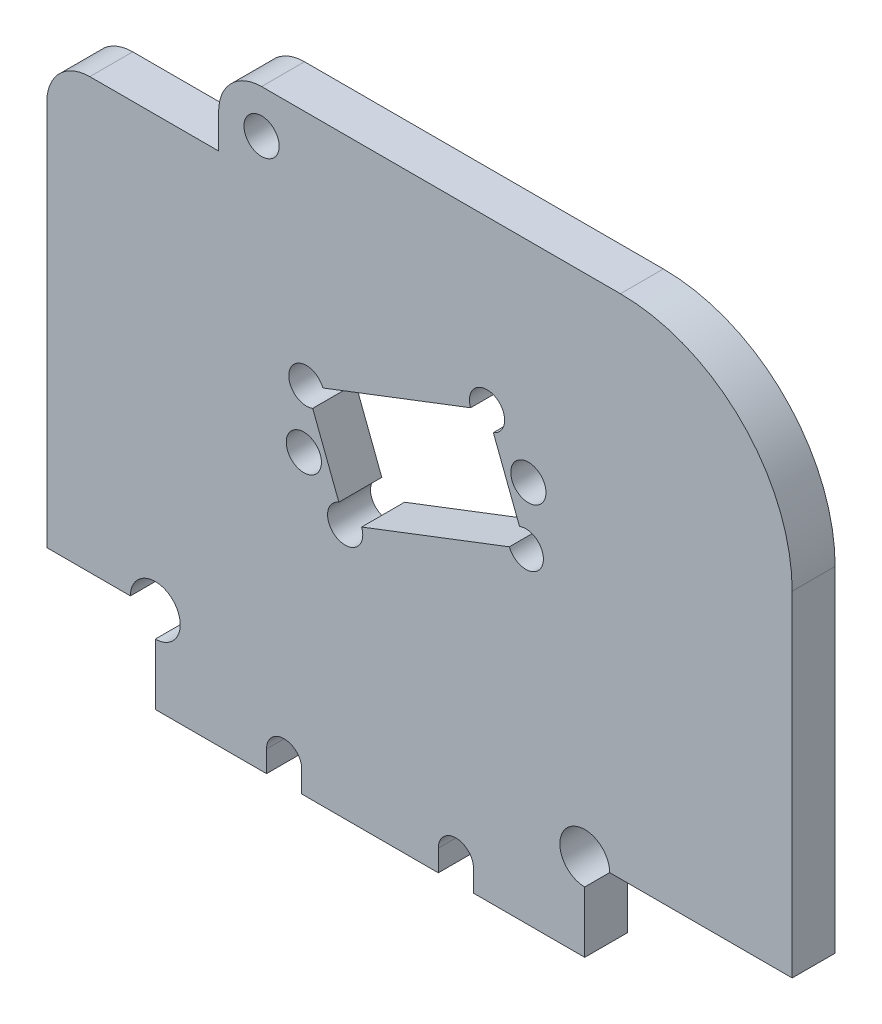
ISO-10303-21;
HEADER;
FILE_DESCRIPTION(('STEP AP214'),'2;1');
FILE_NAME('part.step','',(''),(''),'','','');
FILE_SCHEMA(('AUTOMOTIVE_DESIGN { 1 0 10303 214 1 1 1 1 }'));
ENDSEC;
DATA;
#1=APPLICATION_CONTEXT('core data for automotive mechanical design processes');
#2=APPLICATION_PROTOCOL_DEFINITION('international standard','automotive_design',2000,#1);
#3=PRODUCT_CONTEXT('',#1,'mechanical');
#4=PRODUCT('Part','Part','',(#3));
#5=PRODUCT_RELATED_PRODUCT_CATEGORY('part','',(#4));
#6=PRODUCT_DEFINITION_FORMATION('','',#4);
#7=PRODUCT_DEFINITION_CONTEXT('part definition',#1,'design');
#8=PRODUCT_DEFINITION('design','',#6,#7);
#9=PRODUCT_DEFINITION_SHAPE('','',#8);
#10=(LENGTH_UNIT() NAMED_UNIT(*) SI_UNIT(.MILLI.,.METRE.));
#11=(NAMED_UNIT(*) PLANE_ANGLE_UNIT() SI_UNIT($,.RADIAN.));
#12=(NAMED_UNIT(*) SI_UNIT($,.STERADIAN.) SOLID_ANGLE_UNIT());
#13=UNCERTAINTY_MEASURE_WITH_UNIT(LENGTH_MEASURE(1.E-05),#10,'distance_accuracy_value','');
#14=(GEOMETRIC_REPRESENTATION_CONTEXT(3) GLOBAL_UNCERTAINTY_ASSIGNED_CONTEXT((#13)) GLOBAL_UNIT_ASSIGNED_CONTEXT((#10,
#11,#12)) REPRESENTATION_CONTEXT('',''));
#15=CARTESIAN_POINT('',(0.,0.,0.));
#16=DIRECTION('',(0.,0.,1.));
#17=DIRECTION('',(1.,0.,0.));
#18=AXIS2_PLACEMENT_3D('',#15,#16,#17);
#19=CARTESIAN_POINT('',(0.,-41.3725830020304,5.));
#20=DIRECTION('',(0.,-1.,0.));
#21=DIRECTION('',(1.,0.,0.));
#22=AXIS2_PLACEMENT_3D('',#19,#20,#21);
#23=PLANE('',#22);
#24=DIRECTION('',(0.,0.,1.));
#25=VECTOR('',#24,1.);
#26=CARTESIAN_POINT('',(2.05000000000001,-41.3725830020304,-0.00100000000000013));
#27=LINE('',#26,#25);
#28=CARTESIAN_POINT('',(2.05000000000002,-41.3725830020304,5.));
#29=VERTEX_POINT('',#28);
#30=CARTESIAN_POINT('',(2.05000000000001,-41.3725830020304,0.));
#31=VERTEX_POINT('',#30);
#32=EDGE_CURVE('E542',#29,#31,#27,.F.);
#33=ORIENTED_EDGE('',*,*,#32,.T.);
#34=DIRECTION('',(-1.,0.,0.));
#35=VECTOR('',#34,1.);
#36=CARTESIAN_POINT('',(0.,-41.3725830020304,0.));
#37=LINE('',#36,#35);
#38=CARTESIAN_POINT('',(15.,-41.3725830020305,0.));
#39=VERTEX_POINT('',#38);
#40=EDGE_CURVE('E350',#39,#31,#37,.T.);
#41=ORIENTED_EDGE('',*,*,#40,.F.);
#42=DIRECTION('',(0.,0.,-1.));
#43=VECTOR('',#42,1.);
#44=CARTESIAN_POINT('',(15.,-41.3725830020304,5.));
#45=LINE('',#44,#43);
#46=CARTESIAN_POINT('',(15.,-41.3725830020305,5.));
#47=VERTEX_POINT('',#46);
#48=EDGE_CURVE('E501',#47,#39,#45,.T.);
#49=ORIENTED_EDGE('',*,*,#48,.F.);
#50=DIRECTION('',(-1.,0.,0.));
#51=VECTOR('',#50,1.);
#52=CARTESIAN_POINT('',(0.,-41.3725830020304,5.));
#53=LINE('',#52,#51);
#54=EDGE_CURVE('E310',#47,#29,#53,.T.);
#55=ORIENTED_EDGE('',*,*,#54,.T.);
#56=EDGE_LOOP('',(#33,#41,#49,#55));
#57=FACE_BOUND('',#56,.T.);
#58=ADVANCED_FACE('F69',(#57),#23,.T.);
#59=DIRECTION('',(0.,0.,1.));
#60=VECTOR('',#59,1.);
#61=CARTESIAN_POINT('',(-2.05000000000001,-41.3725830020304,-0.00100000000000013));
#62=LINE('',#61,#60);
#63=CARTESIAN_POINT('',(-2.05000000000001,-41.3725830020304,0.));
#64=VERTEX_POINT('',#63);
#65=CARTESIAN_POINT('',(-2.05000000000001,-41.3725830020304,5.));
#66=VERTEX_POINT('',#65);
#67=EDGE_CURVE('E465',#64,#66,#62,.T.);
#68=ORIENTED_EDGE('',*,*,#67,.T.);
#69=CARTESIAN_POINT('',(-17.95,-41.3725830020304,5.));
#70=VERTEX_POINT('',#69);
#71=EDGE_CURVE('E314',#66,#70,#53,.T.);
#72=ORIENTED_EDGE('',*,*,#71,.T.);
#73=DIRECTION('',(0.,0.,1.));
#74=VECTOR('',#73,1.);
#75=CARTESIAN_POINT('',(-17.95,-41.3725830020305,-0.00100000000000013));
#76=LINE('',#75,#74);
#77=CARTESIAN_POINT('',(-17.95,-41.3725830020305,0.));
#78=VERTEX_POINT('',#77);
#79=EDGE_CURVE('E463',#70,#78,#76,.F.);
#80=ORIENTED_EDGE('',*,*,#79,.T.);
#81=EDGE_CURVE('E354',#64,#78,#37,.T.);
#82=ORIENTED_EDGE('',*,*,#81,.F.);
#83=EDGE_LOOP('',(#68,#72,#80,#82));
#84=FACE_BOUND('',#83,.T.);
#85=ADVANCED_FACE('F461',(#84),#23,.T.);
#86=DIRECTION('',(0.,0.,1.));
#87=VECTOR('',#86,1.);
#88=CARTESIAN_POINT('',(-22.05,-41.3725830020305,-0.00100000000000013));
#89=LINE('',#88,#87);
#90=CARTESIAN_POINT('',(-22.05,-41.3725830020305,0.));
#91=VERTEX_POINT('',#90);
#92=CARTESIAN_POINT('',(-22.05,-41.3725830020305,5.));
#93=VERTEX_POINT('',#92);
#94=EDGE_CURVE('E454',#91,#93,#89,.T.);
#95=ORIENTED_EDGE('',*,*,#94,.T.);
#96=CARTESIAN_POINT('',(-35.,-41.3725830020305,5.));
#97=VERTEX_POINT('',#96);
#98=EDGE_CURVE('E315',#93,#97,#53,.T.);
#99=ORIENTED_EDGE('',*,*,#98,.T.);
#100=DIRECTION('',(0.,0.,-1.));
#101=VECTOR('',#100,1.);
#102=CARTESIAN_POINT('',(-35.,-41.3725830020305,5.));
#103=LINE('',#102,#101);
#104=CARTESIAN_POINT('',(-35.,-41.3725830020305,0.));
#105=VERTEX_POINT('',#104);
#106=EDGE_CURVE('E349',#97,#105,#103,.T.);
#107=ORIENTED_EDGE('',*,*,#106,.T.);
#108=EDGE_CURVE('E355',#91,#105,#37,.T.);
#109=ORIENTED_EDGE('',*,*,#108,.F.);
#110=EDGE_LOOP('',(#95,#99,#107,#109));
#111=FACE_BOUND('',#110,.T.);
#112=ADVANCED_FACE('F453',(#111),#23,.T.);
#113=CARTESIAN_POINT('',(39.1556032311289,0.,5.));
#114=DIRECTION('',(-1.,0.,0.));
#115=DIRECTION('',(0.,-1.,0.));
#116=AXIS2_PLACEMENT_3D('',#113,#114,#115);
#117=PLANE('',#116);
#118=DIRECTION('',(0.,1.,0.));
#119=VECTOR('',#118,1.);
#120=CARTESIAN_POINT('',(39.1556032311289,0.,5.));
#121=LINE('',#120,#119);
#122=CARTESIAN_POINT('',(39.1556032311289,-31.3725830020305,5.));
#123=VERTEX_POINT('',#122);
#124=CARTESIAN_POINT('',(39.1556032311289,7.62741699796956,5.));
#125=VERTEX_POINT('',#124);
#126=EDGE_CURVE('E313',#123,#125,#121,.T.);
#127=ORIENTED_EDGE('',*,*,#126,.F.);
#128=DIRECTION('',(0.,0.,-1.));
#129=VECTOR('',#128,1.);
#130=CARTESIAN_POINT('',(39.1556032311289,-31.3725830020305,10.));
#131=LINE('',#130,#129);
#132=CARTESIAN_POINT('',(39.1556032311289,-31.3725830020305,0.));
#133=VERTEX_POINT('',#132);
#134=EDGE_CURVE('E493',#123,#133,#131,.T.);
#135=ORIENTED_EDGE('',*,*,#134,.T.);
#136=DIRECTION('',(0.,1.,0.));
#137=VECTOR('',#136,1.);
#138=CARTESIAN_POINT('',(39.1556032311289,0.,0.));
#139=LINE('',#138,#137);
#140=CARTESIAN_POINT('',(39.1556032311289,7.62741699796956,0.));
#141=VERTEX_POINT('',#140);
#142=EDGE_CURVE('E353',#133,#141,#139,.T.);
#143=ORIENTED_EDGE('',*,*,#142,.T.);
#144=DIRECTION('',(0.,0.,-1.));
#145=VECTOR('',#144,1.);
#146=CARTESIAN_POINT('',(39.1556032311289,7.62741699796956,5.));
#147=LINE('',#146,#145);
#148=EDGE_CURVE('E402',#125,#141,#147,.T.);
#149=ORIENTED_EDGE('',*,*,#148,.F.);
#150=EDGE_LOOP('',(#127,#135,#143,#149));
#151=FACE_BOUND('',#150,.T.);
#152=ADVANCED_FACE('F618',(#151),#117,.F.);
#153=CARTESIAN_POINT('',(19.1556032311289,7.62741699796956,5.));
#154=DIRECTION('',(0.,0.,-1.));
#155=DIRECTION('',(-1.,0.,0.));
#156=AXIS2_PLACEMENT_3D('',#153,#154,#155);
#157=CYLINDRICAL_SURFACE('',#156,20.);
#158=CARTESIAN_POINT('',(19.1556032311289,7.62741699796956,0.));
#159=DIRECTION('',(0.,0.,1.));
#160=DIRECTION('',(1.,0.,0.));
#161=AXIS2_PLACEMENT_3D('',#158,#159,#160);
#162=CIRCLE('',#161,20.);
#163=CARTESIAN_POINT('',(19.1556032311289,27.6274169979696,0.));
#164=VERTEX_POINT('',#163);
#165=EDGE_CURVE('E357',#164,#141,#162,.F.);
#166=ORIENTED_EDGE('',*,*,#165,.F.);
#167=DIRECTION('',(0.,0.,-1.));
#168=VECTOR('',#167,1.);
#169=CARTESIAN_POINT('',(19.1556032311289,27.6274169979696,5.));
#170=LINE('',#169,#168);
#171=CARTESIAN_POINT('',(19.1556032311289,27.6274169979696,5.));
#172=VERTEX_POINT('',#171);
#173=EDGE_CURVE('E400',#172,#164,#170,.T.);
#174=ORIENTED_EDGE('',*,*,#173,.F.);
#175=CARTESIAN_POINT('',(19.1556032311289,7.62741699796956,5.));
#176=DIRECTION('',(0.,0.,1.));
#177=DIRECTION('',(1.,0.,0.));
#178=AXIS2_PLACEMENT_3D('',#175,#176,#177);
#179=CIRCLE('',#178,20.);
#180=EDGE_CURVE('E317',#172,#125,#179,.F.);
#181=ORIENTED_EDGE('',*,*,#180,.T.);
#182=ORIENTED_EDGE('',*,*,#148,.T.);
#183=EDGE_LOOP('',(#166,#174,#181,#182));
#184=FACE_BOUND('',#183,.T.);
#185=ADVANCED_FACE('F622',(#184),#157,.T.);
#186=CARTESIAN_POINT('',(0.,27.6274169979696,5.));
#187=DIRECTION('',(0.,1.,0.));
#188=DIRECTION('',(-1.,0.,0.));
#189=AXIS2_PLACEMENT_3D('',#186,#187,#188);
#190=PLANE('',#189);
#191=DIRECTION('',(1.,0.,0.));
#192=VECTOR('',#191,1.);
#193=CARTESIAN_POINT('',(0.,27.6274169979696,0.));
#194=LINE('',#193,#192);
#195=CARTESIAN_POINT('',(-22.6274169979695,27.6274169979696,0.));
#196=VERTEX_POINT('',#195);
#197=EDGE_CURVE('E360',#196,#164,#194,.T.);
#198=ORIENTED_EDGE('',*,*,#197,.F.);
#199=DIRECTION('',(0.,0.,-1.));
#200=VECTOR('',#199,1.);
#201=CARTESIAN_POINT('',(-22.6274169979695,27.6274169979696,5.));
#202=LINE('',#201,#200);
#203=CARTESIAN_POINT('',(-22.6274169979695,27.6274169979696,5.));
#204=VERTEX_POINT('',#203);
#205=EDGE_CURVE('E398',#204,#196,#202,.T.);
#206=ORIENTED_EDGE('',*,*,#205,.F.);
#207=DIRECTION('',(1.,0.,0.));
#208=VECTOR('',#207,1.);
#209=CARTESIAN_POINT('',(0.,27.6274169979696,5.));
#210=LINE('',#209,#208);
#211=EDGE_CURVE('E320',#204,#172,#210,.T.);
#212=ORIENTED_EDGE('',*,*,#211,.T.);
#213=ORIENTED_EDGE('',*,*,#173,.T.);
#214=EDGE_LOOP('',(#198,#206,#212,#213));
#215=FACE_BOUND('',#214,.T.);
#216=ADVANCED_FACE('F627',(#215),#190,.T.);
#217=CARTESIAN_POINT('',(-22.6274169979695,22.6274169979696,5.));
#218=DIRECTION('',(0.,0.,-1.));
#219=DIRECTION('',(-1.,0.,0.));
#220=AXIS2_PLACEMENT_3D('',#217,#218,#219);
#221=CYLINDRICAL_SURFACE('',#220,5.);
#222=CARTESIAN_POINT('',(-22.6274169979695,22.6274169979696,0.));
#223=DIRECTION('',(0.,0.,1.));
#224=DIRECTION('',(1.,0.,0.));
#225=AXIS2_PLACEMENT_3D('',#222,#223,#224);
#226=CIRCLE('',#225,5.);
#227=CARTESIAN_POINT('',(-27.6274169979695,22.6274169979696,0.));
#228=VERTEX_POINT('',#227);
#229=EDGE_CURVE('E363',#228,#196,#226,.F.);
#230=ORIENTED_EDGE('',*,*,#229,.F.);
#231=DIRECTION('',(0.,0.,-1.));
#232=VECTOR('',#231,1.);
#233=CARTESIAN_POINT('',(-27.6274169979695,22.6274169979696,5.));
#234=LINE('',#233,#232);
#235=CARTESIAN_POINT('',(-27.6274169979695,22.6274169979696,5.));
#236=VERTEX_POINT('',#235);
#237=EDGE_CURVE('E396',#236,#228,#234,.T.);
#238=ORIENTED_EDGE('',*,*,#237,.F.);
#239=CARTESIAN_POINT('',(-22.6274169979695,22.6274169979696,5.));
#240=DIRECTION('',(0.,0.,1.));
#241=DIRECTION('',(1.,0.,0.));
#242=AXIS2_PLACEMENT_3D('',#239,#240,#241);
#243=CIRCLE('',#242,5.);
#244=EDGE_CURVE('E323',#236,#204,#243,.F.);
#245=ORIENTED_EDGE('',*,*,#244,.T.);
#246=ORIENTED_EDGE('',*,*,#205,.T.);
#247=EDGE_LOOP('',(#230,#238,#245,#246));
#248=FACE_BOUND('',#247,.T.);
#249=ADVANCED_FACE('F634',(#248),#221,.T.);
#250=CARTESIAN_POINT('',(-27.6274169979695,0.,5.));
#251=DIRECTION('',(-1.,0.,0.));
#252=DIRECTION('',(0.,0.,1.));
#253=AXIS2_PLACEMENT_3D('',#250,#251,#252);
#254=PLANE('',#253);
#255=DIRECTION('',(0.,1.,0.));
#256=VECTOR('',#255,1.);
#257=CARTESIAN_POINT('',(-27.6274169979695,0.,0.));
#258=LINE('',#257,#256);
#259=CARTESIAN_POINT('',(-27.6274169979695,18.6274169979696,0.));
#260=VERTEX_POINT('',#259);
#261=EDGE_CURVE('E366',#260,#228,#258,.T.);
#262=ORIENTED_EDGE('',*,*,#261,.F.);
#263=DIRECTION('',(0.,0.,-1.));
#264=VECTOR('',#263,1.);
#265=CARTESIAN_POINT('',(-27.6274169979695,18.6274169979696,5.));
#266=LINE('',#265,#264);
#267=CARTESIAN_POINT('',(-27.6274169979695,18.6274169979696,5.));
#268=VERTEX_POINT('',#267);
#269=EDGE_CURVE('E394',#268,#260,#266,.T.);
#270=ORIENTED_EDGE('',*,*,#269,.F.);
#271=DIRECTION('',(0.,1.,0.));
#272=VECTOR('',#271,1.);
#273=CARTESIAN_POINT('',(-27.6274169979695,0.,5.));
#274=LINE('',#273,#272);
#275=EDGE_CURVE('E326',#268,#236,#274,.T.);
#276=ORIENTED_EDGE('',*,*,#275,.T.);
#277=ORIENTED_EDGE('',*,*,#237,.T.);
#278=EDGE_LOOP('',(#262,#270,#276,#277));
#279=FACE_BOUND('',#278,.T.);
#280=ADVANCED_FACE('F638',(#279),#254,.T.);
#281=CARTESIAN_POINT('',(0.,18.6274169979696,5.));
#282=DIRECTION('',(0.,-1.,0.));
#283=DIRECTION('',(1.,0.,0.));
#284=AXIS2_PLACEMENT_3D('',#281,#282,#283);
#285=PLANE('',#284);
#286=DIRECTION('',(-1.,0.,0.));
#287=VECTOR('',#286,1.);
#288=CARTESIAN_POINT('',(0.,18.6274169979696,0.));
#289=LINE('',#288,#287);
#290=CARTESIAN_POINT('',(-42.6274169979695,18.6274169979696,0.));
#291=VERTEX_POINT('',#290);
#292=EDGE_CURVE('E369',#260,#291,#289,.T.);
#293=ORIENTED_EDGE('',*,*,#292,.T.);
#294=DIRECTION('',(0.,0.,-1.));
#295=VECTOR('',#294,1.);
#296=CARTESIAN_POINT('',(-42.6274169979695,18.6274169979696,5.));
#297=LINE('',#296,#295);
#298=CARTESIAN_POINT('',(-42.6274169979695,18.6274169979696,5.));
#299=VERTEX_POINT('',#298);
#300=EDGE_CURVE('E77',#291,#299,#297,.F.);
#301=ORIENTED_EDGE('',*,*,#300,.T.);
#302=DIRECTION('',(-1.,0.,0.));
#303=VECTOR('',#302,1.);
#304=CARTESIAN_POINT('',(0.,18.6274169979696,5.));
#305=LINE('',#304,#303);
#306=EDGE_CURVE('E329',#268,#299,#305,.T.);
#307=ORIENTED_EDGE('',*,*,#306,.F.);
#308=ORIENTED_EDGE('',*,*,#269,.T.);
#309=EDGE_LOOP('',(#293,#301,#307,#308));
#310=FACE_BOUND('',#309,.T.);
#311=ADVANCED_FACE('F414',(#310),#285,.F.);
#312=CARTESIAN_POINT('',(-47.6274169979695,0.,5.));
#313=DIRECTION('',(-1.,0.,0.));
#314=DIRECTION('',(0.,0.,1.));
#315=AXIS2_PLACEMENT_3D('',#312,#313,#314);
#316=PLANE('',#315);
#317=DIRECTION('',(0.,1.,0.));
#318=VECTOR('',#317,1.);
#319=CARTESIAN_POINT('',(-47.6274169979695,0.,5.));
#320=LINE('',#319,#318);
#321=CARTESIAN_POINT('',(-47.6274169979695,-31.3725830020305,5.));
#322=VERTEX_POINT('',#321);
#323=CARTESIAN_POINT('',(-47.6274169979695,13.6274169979696,5.));
#324=VERTEX_POINT('',#323);
#325=EDGE_CURVE('E332',#322,#324,#320,.T.);
#326=ORIENTED_EDGE('',*,*,#325,.T.);
#327=DIRECTION('',(0.,0.,-1.));
#328=VECTOR('',#327,1.);
#329=CARTESIAN_POINT('',(-47.6274169979695,13.6274169979696,0.));
#330=LINE('',#329,#328);
#331=CARTESIAN_POINT('',(-47.6274169979695,13.6274169979696,0.));
#332=VERTEX_POINT('',#331);
#333=EDGE_CURVE('E407',#324,#332,#330,.T.);
#334=ORIENTED_EDGE('',*,*,#333,.T.);
#335=DIRECTION('',(0.,1.,0.));
#336=VECTOR('',#335,1.);
#337=CARTESIAN_POINT('',(-47.6274169979695,0.,0.));
#338=LINE('',#337,#336);
#339=CARTESIAN_POINT('',(-47.6274169979695,-31.3725830020305,0.));
#340=VERTEX_POINT('',#339);
#341=EDGE_CURVE('E372',#340,#332,#338,.T.);
#342=ORIENTED_EDGE('',*,*,#341,.F.);
#343=DIRECTION('',(0.,0.,-1.));
#344=VECTOR('',#343,1.);
#345=CARTESIAN_POINT('',(-47.6274169979695,-31.3725830020305,5.));
#346=LINE('',#345,#344);
#347=EDGE_CURVE('E391',#322,#340,#346,.T.);
#348=ORIENTED_EDGE('',*,*,#347,.F.);
#349=EDGE_LOOP('',(#326,#334,#342,#348));
#350=FACE_BOUND('',#349,.T.);
#351=ADVANCED_FACE('F426',(#350),#316,.T.);
#352=CARTESIAN_POINT('',(0.,-31.3725830020304,5.));
#353=DIRECTION('',(0.,-1.,0.));
#354=DIRECTION('',(1.,0.,0.));
#355=AXIS2_PLACEMENT_3D('',#352,#353,#354);
#356=PLANE('',#355);
#357=DIRECTION('',(0.,0.,1.));
#358=VECTOR('',#357,1.);
#359=CARTESIAN_POINT('',(-37.8991378028648,-31.3725830020304,-0.00100000000000013));
#360=LINE('',#359,#358);
#361=CARTESIAN_POINT('',(-37.8991378028648,-31.3725830020304,0.));
#362=VERTEX_POINT('',#361);
#363=CARTESIAN_POINT('',(-37.8991378028648,-31.3725830020304,5.));
#364=VERTEX_POINT('',#363);
#365=EDGE_CURVE('E442',#362,#364,#360,.T.);
#366=ORIENTED_EDGE('',*,*,#365,.T.);
#367=DIRECTION('',(-1.,0.,0.));
#368=VECTOR('',#367,1.);
#369=CARTESIAN_POINT('',(0.,-31.3725830020304,5.));
#370=LINE('',#369,#368);
#371=EDGE_CURVE('E335',#364,#322,#370,.T.);
#372=ORIENTED_EDGE('',*,*,#371,.T.);
#373=ORIENTED_EDGE('',*,*,#347,.T.);
#374=DIRECTION('',(-1.,0.,0.));
#375=VECTOR('',#374,1.);
#376=CARTESIAN_POINT('',(0.,-31.3725830020304,0.));
#377=LINE('',#376,#375);
#378=EDGE_CURVE('E375',#362,#340,#377,.T.);
#379=ORIENTED_EDGE('',*,*,#378,.F.);
#380=EDGE_LOOP('',(#366,#372,#373,#379));
#381=FACE_BOUND('',#380,.T.);
#382=ADVANCED_FACE('F436',(#381),#356,.T.);
#383=CARTESIAN_POINT('',(-22.6274169979695,22.6274169979696,5.));
#384=DIRECTION('',(0.,0.,-1.));
#385=DIRECTION('',(-1.,0.,0.));
#386=AXIS2_PLACEMENT_3D('',#383,#384,#385);
#387=CYLINDRICAL_SURFACE('',#386,2.05);
#388=CARTESIAN_POINT('',(-22.6274169979695,22.6274169979696,5.));
#389=DIRECTION('',(0.,0.,1.));
#390=DIRECTION('',(1.,0.,0.));
#391=AXIS2_PLACEMENT_3D('',#388,#389,#390);
#392=CIRCLE('',#391,2.05);
#393=CARTESIAN_POINT('',(-20.5774169979695,22.6274169979696,5.));
#394=VERTEX_POINT('',#393);
#395=EDGE_CURVE('E343',#394,#394,#392,.T.);
#396=ORIENTED_EDGE('',*,*,#395,.T.);
#397=EDGE_LOOP('',(#396));
#398=FACE_BOUND('',#397,.T.);
#399=CARTESIAN_POINT('',(-22.6274169979695,22.6274169979696,0.));
#400=DIRECTION('',(0.,0.,1.));
#401=DIRECTION('',(1.,0.,0.));
#402=AXIS2_PLACEMENT_3D('',#399,#400,#401);
#403=CIRCLE('',#402,2.05);
#404=CARTESIAN_POINT('',(-20.5774169979695,22.6274169979696,0.));
#405=VERTEX_POINT('',#404);
#406=EDGE_CURVE('E383',#405,#405,#403,.T.);
#407=ORIENTED_EDGE('',*,*,#406,.F.);
#408=EDGE_LOOP('',(#407));
#409=FACE_BOUND('',#408,.T.);
#410=ADVANCED_FACE('F649',(#398,#409),#387,.F.);
#411=CARTESIAN_POINT('',(0.,-38.8725830020304,5.));
#412=DIRECTION('',(0.,0.,-1.));
#413=DIRECTION('',(-1.,0.,0.));
#414=AXIS2_PLACEMENT_3D('',#411,#412,#413);
#415=CYLINDRICAL_SURFACE('',#414,2.05);
#416=DIRECTION('',(0.,0.,-1.));
#417=VECTOR('',#416,1.);
#418=CARTESIAN_POINT('',(2.05000000000001,-38.8725830020304,5.));
#419=LINE('',#418,#417);
#420=CARTESIAN_POINT('',(2.05000000000001,-38.8725830020304,0.));
#421=VERTEX_POINT('',#420);
#422=CARTESIAN_POINT('',(2.05000000000001,-38.8725830020304,5.));
#423=VERTEX_POINT('',#422);
#424=EDGE_CURVE('E546',#421,#423,#419,.F.);
#425=ORIENTED_EDGE('',*,*,#424,.T.);
#426=CARTESIAN_POINT('',(0.,-38.8725830020304,5.));
#427=DIRECTION('',(0.,0.,1.));
#428=DIRECTION('',(1.,0.,0.));
#429=AXIS2_PLACEMENT_3D('',#426,#427,#428);
#430=CIRCLE('',#429,2.05);
#431=CARTESIAN_POINT('',(-2.05000000000001,-38.8725830020304,5.));
#432=VERTEX_POINT('',#431);
#433=EDGE_CURVE('E340',#423,#432,#430,.T.);
#434=ORIENTED_EDGE('',*,*,#433,.T.);
#435=DIRECTION('',(0.,0.,-1.));
#436=VECTOR('',#435,1.);
#437=CARTESIAN_POINT('',(-2.05,-38.8725830020304,5.));
#438=LINE('',#437,#436);
#439=CARTESIAN_POINT('',(-2.05000000000001,-38.8725830020304,0.));
#440=VERTEX_POINT('',#439);
#441=EDGE_CURVE('E479',#440,#432,#438,.F.);
#442=ORIENTED_EDGE('',*,*,#441,.F.);
#443=CARTESIAN_POINT('',(0.,-38.8725830020304,0.));
#444=DIRECTION('',(0.,0.,1.));
#445=DIRECTION('',(1.,0.,0.));
#446=AXIS2_PLACEMENT_3D('',#443,#444,#445);
#447=CIRCLE('',#446,2.05);
#448=EDGE_CURVE('E380',#421,#440,#447,.T.);
#449=ORIENTED_EDGE('',*,*,#448,.F.);
#450=EDGE_LOOP('',(#425,#434,#442,#449));
#451=FACE_BOUND('',#450,.T.);
#452=ADVANCED_FACE('F653',(#451),#415,.F.);
#453=CARTESIAN_POINT('',(-35.,0.,5.));
#454=DIRECTION('',(-1.,0.,0.));
#455=DIRECTION('',(0.,-1.,0.));
#456=AXIS2_PLACEMENT_3D('',#453,#454,#455);
#457=PLANE('',#456);
#458=DIRECTION('',(0.,0.,1.));
#459=VECTOR('',#458,1.);
#460=CARTESIAN_POINT('',(-35.,-34.2717208048953,-0.00100000000000013));
#461=LINE('',#460,#459);
#462=CARTESIAN_POINT('',(-35.,-34.2717208048953,5.));
#463=VERTEX_POINT('',#462);
#464=CARTESIAN_POINT('',(-35.,-34.2717208048953,0.));
#465=VERTEX_POINT('',#464);
#466=EDGE_CURVE('E449',#463,#465,#461,.F.);
#467=ORIENTED_EDGE('',*,*,#466,.T.);
#468=DIRECTION('',(0.,1.,0.));
#469=VECTOR('',#468,1.);
#470=CARTESIAN_POINT('',(-35.,0.,0.));
#471=LINE('',#470,#469);
#472=EDGE_CURVE('E377',#105,#465,#471,.T.);
#473=ORIENTED_EDGE('',*,*,#472,.F.);
#474=ORIENTED_EDGE('',*,*,#106,.F.);
#475=DIRECTION('',(0.,1.,0.));
#476=VECTOR('',#475,1.);
#477=CARTESIAN_POINT('',(-35.,0.,5.));
#478=LINE('',#477,#476);
#479=EDGE_CURVE('E337',#97,#463,#478,.T.);
#480=ORIENTED_EDGE('',*,*,#479,.T.);
#481=EDGE_LOOP('',(#467,#473,#474,#480));
#482=FACE_BOUND('',#481,.T.);
#483=ADVANCED_FACE('F447',(#482),#457,.T.);
#484=CARTESIAN_POINT('',(-20.,-38.8725830020304,5.));
#485=DIRECTION('',(0.,0.,-1.));
#486=DIRECTION('',(-1.,0.,0.));
#487=AXIS2_PLACEMENT_3D('',#484,#485,#486);
#488=CYLINDRICAL_SURFACE('',#487,2.05);
#489=DIRECTION('',(0.,0.,-1.));
#490=VECTOR('',#489,1.);
#491=CARTESIAN_POINT('',(-17.95,-38.8725830020304,5.));
#492=LINE('',#491,#490);
#493=CARTESIAN_POINT('',(-17.95,-38.8725830020304,0.));
#494=VERTEX_POINT('',#493);
#495=CARTESIAN_POINT('',(-17.95,-38.8725830020304,5.));
#496=VERTEX_POINT('',#495);
#497=EDGE_CURVE('E486',#494,#496,#492,.F.);
#498=ORIENTED_EDGE('',*,*,#497,.T.);
#499=CARTESIAN_POINT('',(-20.,-38.8725830020304,5.));
#500=DIRECTION('',(0.,0.,1.));
#501=DIRECTION('',(1.,0.,0.));
#502=AXIS2_PLACEMENT_3D('',#499,#500,#501);
#503=CIRCLE('',#502,2.05);
#504=CARTESIAN_POINT('',(-22.05,-38.8725830020304,5.));
#505=VERTEX_POINT('',#504);
#506=EDGE_CURVE('E346',#496,#505,#503,.T.);
#507=ORIENTED_EDGE('',*,*,#506,.T.);
#508=DIRECTION('',(0.,0.,-1.));
#509=VECTOR('',#508,1.);
#510=CARTESIAN_POINT('',(-22.05,-38.8725830020304,5.));
#511=LINE('',#510,#509);
#512=CARTESIAN_POINT('',(-22.05,-38.8725830020304,0.));
#513=VERTEX_POINT('',#512);
#514=EDGE_CURVE('E488',#513,#505,#511,.F.);
#515=ORIENTED_EDGE('',*,*,#514,.F.);
#516=CARTESIAN_POINT('',(-20.,-38.8725830020304,0.));
#517=DIRECTION('',(0.,0.,1.));
#518=DIRECTION('',(1.,0.,0.));
#519=AXIS2_PLACEMENT_3D('',#516,#517,#518);
#520=CIRCLE('',#519,2.05);
#521=EDGE_CURVE('E386',#494,#513,#520,.T.);
#522=ORIENTED_EDGE('',*,*,#521,.F.);
#523=EDGE_LOOP('',(#498,#507,#515,#522));
#524=FACE_BOUND('',#523,.T.);
#525=ADVANCED_FACE('F652',(#524),#488,.F.);
#526=CARTESIAN_POINT('',(0.,0.,5.));
#527=DIRECTION('',(0.,0.,1.));
#528=DIRECTION('',(1.,0.,0.));
#529=AXIS2_PLACEMENT_3D('',#526,#527,#528);
#530=PLANE('',#529);
#531=CARTESIAN_POINT('',(-12.8946656720848,-11.6980118552325,5.));
#532=DIRECTION('',(0.,0.,1.));
#533=DIRECTION('',(1.,0.,0.));
#534=AXIS2_PLACEMENT_3D('',#531,#532,#533);
#535=CIRCLE('',#534,2.05);
#536=CARTESIAN_POINT('',(-13.6293199686526,-9.7841719809132,5.));
#537=VERTEX_POINT('',#536);
#538=CARTESIAN_POINT('',(-10.9808257977655,-10.9633575586646,5.));
#539=VERTEX_POINT('',#538);
#540=EDGE_CURVE('E269',#537,#539,#535,.T.);
#541=ORIENTED_EDGE('',*,*,#540,.F.);
#542=DIRECTION('',(-0.358367949545302,0.933580426497201,0.));
#543=VECTOR('',#542,1.);
#544=CARTESIAN_POINT('',(-15.1523837542202,-5.81645516830007,5.));
#545=LINE('',#544,#543);
#546=CARTESIAN_POINT('',(-16.6754475397877,-1.84873835568695,5.));
#547=VERTEX_POINT('',#546);
#548=EDGE_CURVE('E308',#537,#547,#545,.T.);
#549=ORIENTED_EDGE('',*,*,#548,.T.);
#550=CARTESIAN_POINT('',(-17.4101018363556,0.0651015186323113,5.));
#551=DIRECTION('',(0.,0.,1.));
#552=DIRECTION('',(1.,0.,0.));
#553=AXIS2_PLACEMENT_3D('',#550,#551,#552);
#554=CIRCLE('',#553,2.05);
#555=CARTESIAN_POINT('',(-15.4962619620363,0.799755815200181,5.));
#556=VERTEX_POINT('',#555);
#557=EDGE_CURVE('E566',#556,#547,#554,.T.);
#558=ORIENTED_EDGE('',*,*,#557,.F.);
#559=DIRECTION('',(0.933580426497201,0.358367949545301,0.));
#560=VECTOR('',#559,1.);
#561=CARTESIAN_POINT('',(-2.2577180821354,5.88155668693237,5.));
#562=LINE('',#561,#560);
#563=CARTESIAN_POINT('',(1.7096252983071,7.40447712532009,5.));
#564=VERTEX_POINT('',#563);
#565=EDGE_CURVE('E297',#556,#564,#562,.T.);
#566=ORIENTED_EDGE('',*,*,#565,.T.);
#567=CARTESIAN_POINT('',(3.62346517262637,8.13913142188796,5.));
#568=DIRECTION('',(0.,0.,1.));
#569=DIRECTION('',(1.,0.,0.));
#570=AXIS2_PLACEMENT_3D('',#567,#568,#569);
#571=CIRCLE('',#570,2.05);
#572=CARTESIAN_POINT('',(4.35811946919423,6.22529154756869,5.));
#573=VERTEX_POINT('',#572);
#574=EDGE_CURVE('E574',#573,#564,#571,.T.);
#575=ORIENTED_EDGE('',*,*,#574,.F.);
#576=DIRECTION('',(-0.358367949545302,0.933580426497201,0.));
#577=VECTOR('',#576,1.);
#578=CARTESIAN_POINT('',(5.88118325476177,2.25757473495559,5.));
#579=LINE('',#578,#577);
#580=CARTESIAN_POINT('',(7.4042470403293,-1.71014207765752,5.));
#581=VERTEX_POINT('',#580);
#582=EDGE_CURVE('E293',#581,#573,#579,.T.);
#583=ORIENTED_EDGE('',*,*,#582,.F.);
#584=CARTESIAN_POINT('',(8.13890133689717,-3.62398195197678,5.));
#585=DIRECTION('',(0.,0.,1.));
#586=DIRECTION('',(1.,0.,0.));
#587=AXIS2_PLACEMENT_3D('',#584,#585,#586);
#588=CIRCLE('',#587,2.05);
#589=CARTESIAN_POINT('',(6.22506146257791,-4.35863624854465,5.));
#590=VERTEX_POINT('',#589);
#591=EDGE_CURVE('E292',#590,#581,#588,.T.);
#592=ORIENTED_EDGE('',*,*,#591,.F.);
#593=DIRECTION('',(0.933580426497201,0.358367949545303,0.));
#594=VECTOR('',#593,1.);
#595=CARTESIAN_POINT('',(2.25771808213541,-5.88155668693237,5.));
#596=LINE('',#595,#594);
#597=EDGE_CURVE('E284',#539,#590,#596,.T.);
#598=ORIENTED_EDGE('',*,*,#597,.F.);
#599=EDGE_LOOP('',(#541,#549,#558,#566,#575,#583,#592,#598));
#600=FACE_BOUND('',#599,.T.);
#601=CARTESIAN_POINT('',(-35.,-31.3725830020304,5.));
#602=DIRECTION('',(0.,0.,1.));
#603=DIRECTION('',(1.,0.,0.));
#604=AXIS2_PLACEMENT_3D('',#601,#602,#603);
#605=CIRCLE('',#604,2.89913780286485);
#606=EDGE_CURVE('E439',#463,#364,#605,.T.);
#607=ORIENTED_EDGE('',*,*,#606,.F.);
#608=ORIENTED_EDGE('',*,*,#479,.F.);
#609=ORIENTED_EDGE('',*,*,#98,.F.);
#610=DIRECTION('',(0.,-1.,0.));
#611=VECTOR('',#610,1.);
#612=CARTESIAN_POINT('',(-22.05,-38.8725830020304,5.));
#613=LINE('',#612,#611);
#614=EDGE_CURVE('E474',#505,#93,#613,.T.);
#615=ORIENTED_EDGE('',*,*,#614,.F.);
#616=ORIENTED_EDGE('',*,*,#506,.F.);
#617=DIRECTION('',(0.,1.,0.));
#618=VECTOR('',#617,1.);
#619=CARTESIAN_POINT('',(-17.95,-38.8725830020304,5.));
#620=LINE('',#619,#618);
#621=EDGE_CURVE('E471',#70,#496,#620,.T.);
#622=ORIENTED_EDGE('',*,*,#621,.F.);
#623=ORIENTED_EDGE('',*,*,#71,.F.);
#624=DIRECTION('',(0.,-1.,0.));
#625=VECTOR('',#624,1.);
#626=CARTESIAN_POINT('',(-2.05000000000001,-38.8725830020304,5.));
#627=LINE('',#626,#625);
#628=EDGE_CURVE('E469',#432,#66,#627,.T.);
#629=ORIENTED_EDGE('',*,*,#628,.F.);
#630=ORIENTED_EDGE('',*,*,#433,.F.);
#631=DIRECTION('',(0.,1.,0.));
#632=VECTOR('',#631,1.);
#633=CARTESIAN_POINT('',(2.05000000000001,-38.8725830020304,5.));
#634=LINE('',#633,#632);
#635=EDGE_CURVE('E533',#29,#423,#634,.T.);
#636=ORIENTED_EDGE('',*,*,#635,.F.);
#637=ORIENTED_EDGE('',*,*,#54,.F.);
#638=DIRECTION('',(0.,-1.,0.));
#639=VECTOR('',#638,1.);
#640=CARTESIAN_POINT('',(15.,0.,5.));
#641=LINE('',#640,#639);
#642=CARTESIAN_POINT('',(15.,-34.2717208048953,5.));
#643=VERTEX_POINT('',#642);
#644=EDGE_CURVE('E499',#643,#47,#641,.T.);
#645=ORIENTED_EDGE('',*,*,#644,.F.);
#646=CARTESIAN_POINT('',(15.,-31.3725830020304,5.));
#647=DIRECTION('',(0.,0.,1.));
#648=DIRECTION('',(1.,0.,0.));
#649=AXIS2_PLACEMENT_3D('',#646,#647,#648);
#650=CIRCLE('',#649,2.89913780286484);
#651=CARTESIAN_POINT('',(17.8991378028648,-31.3725830020304,5.));
#652=VERTEX_POINT('',#651);
#653=EDGE_CURVE('E551',#652,#643,#650,.T.);
#654=ORIENTED_EDGE('',*,*,#653,.F.);
#655=DIRECTION('',(-1.,0.,0.));
#656=VECTOR('',#655,1.);
#657=CARTESIAN_POINT('',(0.,-31.3725830020304,5.));
#658=LINE('',#657,#656);
#659=EDGE_CURVE('E496',#123,#652,#658,.T.);
#660=ORIENTED_EDGE('',*,*,#659,.F.);
#661=ORIENTED_EDGE('',*,*,#126,.T.);
#662=ORIENTED_EDGE('',*,*,#180,.F.);
#663=ORIENTED_EDGE('',*,*,#211,.F.);
#664=ORIENTED_EDGE('',*,*,#244,.F.);
#665=ORIENTED_EDGE('',*,*,#275,.F.);
#666=ORIENTED_EDGE('',*,*,#306,.T.);
#667=CARTESIAN_POINT('',(-42.6274169979695,13.6274169979696,5.));
#668=DIRECTION('',(0.,0.,1.));
#669=DIRECTION('',(1.,0.,0.));
#670=AXIS2_PLACEMENT_3D('',#667,#668,#669);
#671=CIRCLE('',#670,5.);
#672=EDGE_CURVE('E12',#299,#324,#671,.T.);
#673=ORIENTED_EDGE('',*,*,#672,.T.);
#674=ORIENTED_EDGE('',*,*,#325,.F.);
#675=ORIENTED_EDGE('',*,*,#371,.F.);
#676=EDGE_LOOP('',(#607,#608,#609,#615,#616,#622,#623,#629,#630,#636,#637,#645,#654,#660,#661,
#662,#663,#664,#665,#666,#673,#674,#675));
#677=FACE_BOUND('',#676,.T.);
#678=CARTESIAN_POINT('',(8.43592609187136,3.23824862888631,5.));
#679=DIRECTION('',(0.,0.,1.));
#680=DIRECTION('',(1.,0.,0.));
#681=AXIS2_PLACEMENT_3D('',#678,#679,#680);
#682=CIRCLE('',#681,2.05);
#683=CARTESIAN_POINT('',(10.4859260918714,3.23824862888631,5.));
#684=VERTEX_POINT('',#683);
#685=EDGE_CURVE('E504',#684,#684,#682,.T.);
#686=ORIENTED_EDGE('',*,*,#685,.F.);
#687=EDGE_LOOP('',(#686));
#688=FACE_BOUND('',#687,.T.);
#689=CARTESIAN_POINT('',(-17.707593381543,-6.79730824620556,5.));
#690=DIRECTION('',(0.,0.,1.));
#691=DIRECTION('',(1.,0.,0.));
#692=AXIS2_PLACEMENT_3D('',#689,#690,#691);
#693=CIRCLE('',#692,2.05);
#694=CARTESIAN_POINT('',(-15.657593381543,-6.79730824620556,5.));
#695=VERTEX_POINT('',#694);
#696=EDGE_CURVE('E300',#695,#695,#693,.T.);
#697=ORIENTED_EDGE('',*,*,#696,.F.);
#698=EDGE_LOOP('',(#697));
#699=FACE_BOUND('',#698,.T.);
#700=ORIENTED_EDGE('',*,*,#395,.F.);
#701=EDGE_LOOP('',(#700));
#702=FACE_BOUND('',#701,.T.);
#703=ADVANCED_FACE('F289',(#600,#677,#688,#699,#702),#530,.T.);
#704=CARTESIAN_POINT('',(0.,0.,0.));
#705=DIRECTION('',(0.,0.,1.));
#706=DIRECTION('',(1.,0.,0.));
#707=AXIS2_PLACEMENT_3D('',#704,#705,#706);
#708=PLANE('',#707);
#709=CARTESIAN_POINT('',(8.43592609187136,3.23824862888631,0.));
#710=DIRECTION('',(0.,0.,1.));
#711=DIRECTION('',(1.,0.,0.));
#712=AXIS2_PLACEMENT_3D('',#709,#710,#711);
#713=CIRCLE('',#712,2.05);
#714=CARTESIAN_POINT('',(10.4859260918714,3.23824862888631,0.));
#715=VERTEX_POINT('',#714);
#716=EDGE_CURVE('E505',#715,#715,#713,.T.);
#717=ORIENTED_EDGE('',*,*,#716,.T.);
#718=EDGE_LOOP('',(#717));
#719=FACE_BOUND('',#718,.T.);
#720=CARTESIAN_POINT('',(-17.707593381543,-6.79730824620556,0.));
#721=DIRECTION('',(0.,0.,1.));
#722=DIRECTION('',(1.,0.,0.));
#723=AXIS2_PLACEMENT_3D('',#720,#721,#722);
#724=CIRCLE('',#723,2.05);
#725=CARTESIAN_POINT('',(-15.657593381543,-6.79730824620556,0.));
#726=VERTEX_POINT('',#725);
#727=EDGE_CURVE('E294',#726,#726,#724,.T.);
#728=ORIENTED_EDGE('',*,*,#727,.T.);
#729=EDGE_LOOP('',(#728));
#730=FACE_BOUND('',#729,.T.);
#731=DIRECTION('',(-0.358367949545302,0.933580426497201,0.));
#732=VECTOR('',#731,1.);
#733=CARTESIAN_POINT('',(-15.1523837542202,-5.81645516830007,0.));
#734=LINE('',#733,#732);
#735=CARTESIAN_POINT('',(-13.6293199686526,-9.7841719809132,0.));
#736=VERTEX_POINT('',#735);
#737=CARTESIAN_POINT('',(-16.6754475397877,-1.84873835568695,0.));
#738=VERTEX_POINT('',#737);
#739=EDGE_CURVE('E303',#736,#738,#734,.T.);
#740=ORIENTED_EDGE('',*,*,#739,.F.);
#741=CARTESIAN_POINT('',(-12.8946656720848,-11.6980118552325,0.));
#742=DIRECTION('',(0.,0.,1.));
#743=DIRECTION('',(1.,0.,0.));
#744=AXIS2_PLACEMENT_3D('',#741,#742,#743);
#745=CIRCLE('',#744,2.05);
#746=CARTESIAN_POINT('',(-10.9808257977655,-10.9633575586646,0.));
#747=VERTEX_POINT('',#746);
#748=EDGE_CURVE('E84',#747,#736,#745,.F.);
#749=ORIENTED_EDGE('',*,*,#748,.F.);
#750=DIRECTION('',(0.933580426497201,0.358367949545303,0.));
#751=VECTOR('',#750,1.);
#752=CARTESIAN_POINT('',(2.25771808213541,-5.88155668693237,0.));
#753=LINE('',#752,#751);
#754=CARTESIAN_POINT('',(6.22506146257791,-4.35863624854465,0.));
#755=VERTEX_POINT('',#754);
#756=EDGE_CURVE('E286',#747,#755,#753,.T.);
#757=ORIENTED_EDGE('',*,*,#756,.T.);
#758=CARTESIAN_POINT('',(8.13890133689717,-3.62398195197678,0.));
#759=DIRECTION('',(0.,0.,1.));
#760=DIRECTION('',(1.,0.,0.));
#761=AXIS2_PLACEMENT_3D('',#758,#759,#760);
#762=CIRCLE('',#761,2.05);
#763=CARTESIAN_POINT('',(7.4042470403293,-1.71014207765752,0.));
#764=VERTEX_POINT('',#763);
#765=EDGE_CURVE('E571',#764,#755,#762,.F.);
#766=ORIENTED_EDGE('',*,*,#765,.F.);
#767=DIRECTION('',(-0.358367949545302,0.933580426497201,0.));
#768=VECTOR('',#767,1.);
#769=CARTESIAN_POINT('',(5.88118325476177,2.25757473495559,0.));
#770=LINE('',#769,#768);
#771=CARTESIAN_POINT('',(4.35811946919423,6.2252915475687,0.));
#772=VERTEX_POINT('',#771);
#773=EDGE_CURVE('E513',#764,#772,#770,.T.);
#774=ORIENTED_EDGE('',*,*,#773,.T.);
#775=CARTESIAN_POINT('',(3.62346517262637,8.13913142188796,0.));
#776=DIRECTION('',(0.,0.,1.));
#777=DIRECTION('',(1.,0.,0.));
#778=AXIS2_PLACEMENT_3D('',#775,#776,#777);
#779=CIRCLE('',#778,2.05);
#780=CARTESIAN_POINT('',(1.7096252983071,7.40447712532009,0.));
#781=VERTEX_POINT('',#780);
#782=EDGE_CURVE('E563',#781,#772,#779,.F.);
#783=ORIENTED_EDGE('',*,*,#782,.F.);
#784=DIRECTION('',(0.933580426497201,0.358367949545301,0.));
#785=VECTOR('',#784,1.);
#786=CARTESIAN_POINT('',(-2.2577180821354,5.88155668693237,0.));
#787=LINE('',#786,#785);
#788=CARTESIAN_POINT('',(-15.4962619620363,0.799755815200179,0.));
#789=VERTEX_POINT('',#788);
#790=EDGE_CURVE('E515',#789,#781,#787,.T.);
#791=ORIENTED_EDGE('',*,*,#790,.F.);
#792=CARTESIAN_POINT('',(-17.4101018363556,0.0651015186323113,0.));
#793=DIRECTION('',(0.,0.,1.));
#794=DIRECTION('',(1.,0.,0.));
#795=AXIS2_PLACEMENT_3D('',#792,#793,#794);
#796=CIRCLE('',#795,2.05);
#797=EDGE_CURVE('E92',#738,#789,#796,.F.);
#798=ORIENTED_EDGE('',*,*,#797,.F.);
#799=EDGE_LOOP('',(#740,#749,#757,#766,#774,#783,#791,#798));
#800=FACE_BOUND('',#799,.T.);
#801=ORIENTED_EDGE('',*,*,#472,.T.);
#802=CARTESIAN_POINT('',(-35.,-31.3725830020304,0.));
#803=DIRECTION('',(0.,0.,1.));
#804=DIRECTION('',(1.,0.,0.));
#805=AXIS2_PLACEMENT_3D('',#802,#803,#804);
#806=CIRCLE('',#805,2.89913780286485);
#807=EDGE_CURVE('E433',#362,#465,#806,.F.);
#808=ORIENTED_EDGE('',*,*,#807,.F.);
#809=ORIENTED_EDGE('',*,*,#378,.T.);
#810=ORIENTED_EDGE('',*,*,#341,.T.);
#811=CARTESIAN_POINT('',(-42.6274169979695,13.6274169979696,0.));
#812=DIRECTION('',(0.,0.,1.));
#813=DIRECTION('',(1.,0.,0.));
#814=AXIS2_PLACEMENT_3D('',#811,#812,#813);
#815=CIRCLE('',#814,5.);
#816=EDGE_CURVE('E410',#332,#291,#815,.F.);
#817=ORIENTED_EDGE('',*,*,#816,.T.);
#818=ORIENTED_EDGE('',*,*,#292,.F.);
#819=ORIENTED_EDGE('',*,*,#261,.T.);
#820=ORIENTED_EDGE('',*,*,#229,.T.);
#821=ORIENTED_EDGE('',*,*,#197,.T.);
#822=ORIENTED_EDGE('',*,*,#165,.T.);
#823=ORIENTED_EDGE('',*,*,#142,.F.);
#824=DIRECTION('',(1.,0.,0.));
#825=VECTOR('',#824,1.);
#826=CARTESIAN_POINT('',(15.,-31.3725830020304,0.));
#827=LINE('',#826,#825);
#828=CARTESIAN_POINT('',(17.8991378028648,-31.3725830020304,0.));
#829=VERTEX_POINT('',#828);
#830=EDGE_CURVE('E491',#829,#133,#827,.T.);
#831=ORIENTED_EDGE('',*,*,#830,.F.);
#832=CARTESIAN_POINT('',(15.,-31.3725830020304,0.));
#833=DIRECTION('',(0.,0.,1.));
#834=DIRECTION('',(1.,0.,0.));
#835=AXIS2_PLACEMENT_3D('',#832,#833,#834);
#836=CIRCLE('',#835,2.89913780286484);
#837=CARTESIAN_POINT('',(15.,-34.2717208048953,0.));
#838=VERTEX_POINT('',#837);
#839=EDGE_CURVE('E490',#838,#829,#836,.F.);
#840=ORIENTED_EDGE('',*,*,#839,.F.);
#841=DIRECTION('',(0.,-1.,0.));
#842=VECTOR('',#841,1.);
#843=CARTESIAN_POINT('',(15.,0.,0.));
#844=LINE('',#843,#842);
#845=EDGE_CURVE('E405',#838,#39,#844,.T.);
#846=ORIENTED_EDGE('',*,*,#845,.T.);
#847=ORIENTED_EDGE('',*,*,#40,.T.);
#848=DIRECTION('',(0.,-1.,0.));
#849=VECTOR('',#848,1.);
#850=CARTESIAN_POINT('',(2.05000000000001,-38.8725830020304,0.));
#851=LINE('',#850,#849);
#852=EDGE_CURVE('E540',#421,#31,#851,.T.);
#853=ORIENTED_EDGE('',*,*,#852,.F.);
#854=ORIENTED_EDGE('',*,*,#448,.T.);
#855=DIRECTION('',(0.,1.,0.));
#856=VECTOR('',#855,1.);
#857=CARTESIAN_POINT('',(-2.05000000000001,-38.8725830020304,0.));
#858=LINE('',#857,#856);
#859=EDGE_CURVE('E528',#64,#440,#858,.T.);
#860=ORIENTED_EDGE('',*,*,#859,.F.);
#861=ORIENTED_EDGE('',*,*,#81,.T.);
#862=DIRECTION('',(0.,-1.,0.));
#863=VECTOR('',#862,1.);
#864=CARTESIAN_POINT('',(-17.95,-38.8725830020304,0.));
#865=LINE('',#864,#863);
#866=EDGE_CURVE('E477',#494,#78,#865,.T.);
#867=ORIENTED_EDGE('',*,*,#866,.F.);
#868=ORIENTED_EDGE('',*,*,#521,.T.);
#869=DIRECTION('',(0.,1.,0.));
#870=VECTOR('',#869,1.);
#871=CARTESIAN_POINT('',(-22.05,-38.8725830020304,0.));
#872=LINE('',#871,#870);
#873=EDGE_CURVE('E475',#91,#513,#872,.T.);
#874=ORIENTED_EDGE('',*,*,#873,.F.);
#875=ORIENTED_EDGE('',*,*,#108,.T.);
#876=EDGE_LOOP('',(#801,#808,#809,#810,#817,#818,#819,#820,#821,#822,#823,#831,#840,#846,#847,
#853,#854,#860,#861,#867,#868,#874,#875));
#877=FACE_BOUND('',#876,.T.);
#878=ORIENTED_EDGE('',*,*,#406,.T.);
#879=EDGE_LOOP('',(#878));
#880=FACE_BOUND('',#879,.T.);
#881=ADVANCED_FACE('F429',(#719,#730,#800,#877,#880),#708,.F.);
#882=CARTESIAN_POINT('',(2.25771808213541,-5.88155668693237,0.));
#883=DIRECTION('',(0.358367949545303,-0.933580426497201,0.));
#884=DIRECTION('',(0.933580426497201,0.358367949545303,0.));
#885=AXIS2_PLACEMENT_3D('',#882,#883,#884);
#886=PLANE('',#885);
#887=ORIENTED_EDGE('',*,*,#756,.F.);
#888=DIRECTION('',(0.,0.,1.));
#889=VECTOR('',#888,1.);
#890=CARTESIAN_POINT('',(-10.9808257977655,-10.9633575586646,-0.00100000000000013));
#891=LINE('',#890,#889);
#892=EDGE_CURVE('E272',#539,#747,#891,.F.);
#893=ORIENTED_EDGE('',*,*,#892,.F.);
#894=ORIENTED_EDGE('',*,*,#597,.T.);
#895=DIRECTION('',(0.,0.,1.));
#896=VECTOR('',#895,1.);
#897=CARTESIAN_POINT('',(6.22506146257791,-4.35863624854465,-0.00100000000000013));
#898=LINE('',#897,#896);
#899=EDGE_CURVE('E579',#755,#590,#898,.T.);
#900=ORIENTED_EDGE('',*,*,#899,.F.);
#901=EDGE_LOOP('',(#887,#893,#894,#900));
#902=FACE_BOUND('',#901,.T.);
#903=ADVANCED_FACE('F282',(#902),#886,.F.);
#904=CARTESIAN_POINT('',(-15.1523837542202,-5.81645516830007,0.));
#905=DIRECTION('',(0.933580426497201,0.358367949545302,0.));
#906=DIRECTION('',(-0.358367949545302,0.933580426497201,0.));
#907=AXIS2_PLACEMENT_3D('',#904,#905,#906);
#908=PLANE('',#907);
#909=DIRECTION('',(0.,0.,1.));
#910=VECTOR('',#909,1.);
#911=CARTESIAN_POINT('',(-13.6293199686526,-9.7841719809132,-0.00100000000000013));
#912=LINE('',#911,#910);
#913=EDGE_CURVE('E273',#537,#736,#912,.F.);
#914=ORIENTED_EDGE('',*,*,#913,.T.);
#915=ORIENTED_EDGE('',*,*,#739,.T.);
#916=DIRECTION('',(0.,0.,1.));
#917=VECTOR('',#916,1.);
#918=CARTESIAN_POINT('',(-16.6754475397877,-1.84873835568695,-0.00100000000000013));
#919=LINE('',#918,#917);
#920=EDGE_CURVE('E564',#738,#547,#919,.T.);
#921=ORIENTED_EDGE('',*,*,#920,.T.);
#922=ORIENTED_EDGE('',*,*,#548,.F.);
#923=EDGE_LOOP('',(#914,#915,#921,#922));
#924=FACE_BOUND('',#923,.T.);
#925=ADVANCED_FACE('F583',(#924),#908,.T.);
#926=CARTESIAN_POINT('',(-2.2577180821354,5.88155668693237,0.));
#927=DIRECTION('',(0.358367949545301,-0.933580426497201,0.));
#928=DIRECTION('',(0.933580426497201,0.358367949545301,0.));
#929=AXIS2_PLACEMENT_3D('',#926,#927,#928);
#930=PLANE('',#929);
#931=DIRECTION('',(0.,0.,1.));
#932=VECTOR('',#931,1.);
#933=CARTESIAN_POINT('',(1.7096252983071,7.40447712532009,-0.00100000000000013));
#934=LINE('',#933,#932);
#935=EDGE_CURVE('E572',#781,#564,#934,.T.);
#936=ORIENTED_EDGE('',*,*,#935,.T.);
#937=ORIENTED_EDGE('',*,*,#565,.F.);
#938=DIRECTION('',(0.,0.,1.));
#939=VECTOR('',#938,1.);
#940=CARTESIAN_POINT('',(-15.4962619620363,0.799755815200181,-0.00100000000000013));
#941=LINE('',#940,#939);
#942=EDGE_CURVE('E561',#556,#789,#941,.F.);
#943=ORIENTED_EDGE('',*,*,#942,.T.);
#944=ORIENTED_EDGE('',*,*,#790,.T.);
#945=EDGE_LOOP('',(#936,#937,#943,#944));
#946=FACE_BOUND('',#945,.T.);
#947=ADVANCED_FACE('F597',(#946),#930,.T.);
#948=CARTESIAN_POINT('',(5.88118325476177,2.25757473495559,0.));
#949=DIRECTION('',(0.933580426497201,0.358367949545302,0.));
#950=DIRECTION('',(-0.358367949545302,0.933580426497201,0.));
#951=AXIS2_PLACEMENT_3D('',#948,#949,#950);
#952=PLANE('',#951);
#953=ORIENTED_EDGE('',*,*,#773,.F.);
#954=DIRECTION('',(0.,0.,1.));
#955=VECTOR('',#954,1.);
#956=CARTESIAN_POINT('',(7.4042470403293,-1.71014207765752,-0.00100000000000013));
#957=LINE('',#956,#955);
#958=EDGE_CURVE('E577',#581,#764,#957,.F.);
#959=ORIENTED_EDGE('',*,*,#958,.F.);
#960=ORIENTED_EDGE('',*,*,#582,.T.);
#961=DIRECTION('',(0.,0.,1.));
#962=VECTOR('',#961,1.);
#963=CARTESIAN_POINT('',(4.35811946919423,6.22529154756869,-0.00100000000000013));
#964=LINE('',#963,#962);
#965=EDGE_CURVE('E569',#772,#573,#964,.T.);
#966=ORIENTED_EDGE('',*,*,#965,.F.);
#967=EDGE_LOOP('',(#953,#959,#960,#966));
#968=FACE_BOUND('',#967,.T.);
#969=ADVANCED_FACE('F593',(#968),#952,.F.);
#970=CARTESIAN_POINT('',(-17.707593381543,-6.79730824620556,0.));
#971=DIRECTION('',(0.,0.,1.));
#972=DIRECTION('',(1.,0.,0.));
#973=AXIS2_PLACEMENT_3D('',#970,#971,#972);
#974=CYLINDRICAL_SURFACE('',#973,2.05);
#975=ORIENTED_EDGE('',*,*,#727,.F.);
#976=EDGE_LOOP('',(#975));
#977=FACE_BOUND('',#976,.T.);
#978=ORIENTED_EDGE('',*,*,#696,.T.);
#979=EDGE_LOOP('',(#978));
#980=FACE_BOUND('',#979,.T.);
#981=ADVANCED_FACE('F672',(#977,#980),#974,.F.);
#982=CARTESIAN_POINT('',(8.43592609187136,3.23824862888631,0.));
#983=DIRECTION('',(0.,0.,1.));
#984=DIRECTION('',(1.,0.,0.));
#985=AXIS2_PLACEMENT_3D('',#982,#983,#984);
#986=CYLINDRICAL_SURFACE('',#985,2.05);
#987=ORIENTED_EDGE('',*,*,#716,.F.);
#988=EDGE_LOOP('',(#987));
#989=FACE_BOUND('',#988,.T.);
#990=ORIENTED_EDGE('',*,*,#685,.T.);
#991=EDGE_LOOP('',(#990));
#992=FACE_BOUND('',#991,.T.);
#993=ADVANCED_FACE('F679',(#989,#992),#986,.F.);
#994=CARTESIAN_POINT('',(15.,-50.,10.));
#995=DIRECTION('',(-1.,0.,0.));
#996=DIRECTION('',(0.,0.,1.));
#997=AXIS2_PLACEMENT_3D('',#994,#995,#996);
#998=PLANE('',#997);
#999=ORIENTED_EDGE('',*,*,#845,.F.);
#1000=DIRECTION('',(0.,0.,1.));
#1001=VECTOR('',#1000,1.);
#1002=CARTESIAN_POINT('',(15.,-34.2717208048953,-0.00100000000000013));
#1003=LINE('',#1002,#1001);
#1004=EDGE_CURVE('E553',#643,#838,#1003,.F.);
#1005=ORIENTED_EDGE('',*,*,#1004,.F.);
#1006=ORIENTED_EDGE('',*,*,#644,.T.);
#1007=ORIENTED_EDGE('',*,*,#48,.T.);
#1008=EDGE_LOOP('',(#999,#1005,#1006,#1007));
#1009=FACE_BOUND('',#1008,.T.);
#1010=ADVANCED_FACE('F683',(#1009),#998,.F.);
#1011=CARTESIAN_POINT('',(15.,-31.3725830020304,10.));
#1012=DIRECTION('',(0.,1.,0.));
#1013=DIRECTION('',(-1.,0.,0.));
#1014=AXIS2_PLACEMENT_3D('',#1011,#1012,#1013);
#1015=PLANE('',#1014);
#1016=ORIENTED_EDGE('',*,*,#659,.T.);
#1017=DIRECTION('',(0.,0.,1.));
#1018=VECTOR('',#1017,1.);
#1019=CARTESIAN_POINT('',(17.8991378028648,-31.3725830020304,-0.00100000000000013));
#1020=LINE('',#1019,#1018);
#1021=EDGE_CURVE('E554',#829,#652,#1020,.T.);
#1022=ORIENTED_EDGE('',*,*,#1021,.F.);
#1023=ORIENTED_EDGE('',*,*,#830,.T.);
#1024=ORIENTED_EDGE('',*,*,#134,.F.);
#1025=EDGE_LOOP('',(#1016,#1022,#1023,#1024));
#1026=FACE_BOUND('',#1025,.T.);
#1027=ADVANCED_FACE('F687',(#1026),#1015,.F.);
#1028=CARTESIAN_POINT('',(-42.6274169979695,13.6274169979696,5.));
#1029=DIRECTION('',(0.,0.,1.));
#1030=DIRECTION('',(1.,0.,0.));
#1031=AXIS2_PLACEMENT_3D('',#1028,#1029,#1030);
#1032=CYLINDRICAL_SURFACE('',#1031,5.);
#1033=ORIENTED_EDGE('',*,*,#672,.F.);
#1034=ORIENTED_EDGE('',*,*,#300,.F.);
#1035=ORIENTED_EDGE('',*,*,#816,.F.);
#1036=ORIENTED_EDGE('',*,*,#333,.F.);
#1037=EDGE_LOOP('',(#1033,#1034,#1035,#1036));
#1038=FACE_BOUND('',#1037,.T.);
#1039=ADVANCED_FACE('F71',(#1038),#1032,.T.);
#1040=CARTESIAN_POINT('',(15.,-31.3725830020304,-0.00100000000000013));
#1041=DIRECTION('',(0.,0.,1.));
#1042=DIRECTION('',(1.,0.,0.));
#1043=AXIS2_PLACEMENT_3D('',#1040,#1041,#1042);
#1044=CYLINDRICAL_SURFACE('',#1043,2.89913780286484);
#1045=ORIENTED_EDGE('',*,*,#1004,.T.);
#1046=ORIENTED_EDGE('',*,*,#839,.T.);
#1047=ORIENTED_EDGE('',*,*,#1021,.T.);
#1048=ORIENTED_EDGE('',*,*,#653,.T.);
#1049=EDGE_LOOP('',(#1045,#1046,#1047,#1048));
#1050=FACE_BOUND('',#1049,.T.);
#1051=ADVANCED_FACE('F699',(#1050),#1044,.F.);
#1052=CARTESIAN_POINT('',(-22.05,-38.8725830020304,-0.00100000000000013));
#1053=DIRECTION('',(-1.,0.,0.));
#1054=DIRECTION('',(0.,0.,1.));
#1055=AXIS2_PLACEMENT_3D('',#1052,#1053,#1054);
#1056=PLANE('',#1055);
#1057=ORIENTED_EDGE('',*,*,#873,.T.);
#1058=ORIENTED_EDGE('',*,*,#514,.T.);
#1059=ORIENTED_EDGE('',*,*,#614,.T.);
#1060=ORIENTED_EDGE('',*,*,#94,.F.);
#1061=EDGE_LOOP('',(#1057,#1058,#1059,#1060));
#1062=FACE_BOUND('',#1061,.T.);
#1063=ADVANCED_FACE('F696',(#1062),#1056,.F.);
#1064=CARTESIAN_POINT('',(-17.95,-38.8725830020304,-0.00100000000000013));
#1065=DIRECTION('',(1.,0.,0.));
#1066=DIRECTION('',(0.,0.,-1.));
#1067=AXIS2_PLACEMENT_3D('',#1064,#1065,#1066);
#1068=PLANE('',#1067);
#1069=ORIENTED_EDGE('',*,*,#866,.T.);
#1070=ORIENTED_EDGE('',*,*,#79,.F.);
#1071=ORIENTED_EDGE('',*,*,#621,.T.);
#1072=ORIENTED_EDGE('',*,*,#497,.F.);
#1073=EDGE_LOOP('',(#1069,#1070,#1071,#1072));
#1074=FACE_BOUND('',#1073,.T.);
#1075=ADVANCED_FACE('F692',(#1074),#1068,.F.);
#1076=CARTESIAN_POINT('',(-2.05000000000001,-38.8725830020304,-0.00100000000000013));
#1077=DIRECTION('',(-1.,0.,0.));
#1078=DIRECTION('',(0.,-1.,0.));
#1079=AXIS2_PLACEMENT_3D('',#1076,#1077,#1078);
#1080=PLANE('',#1079);
#1081=ORIENTED_EDGE('',*,*,#859,.T.);
#1082=ORIENTED_EDGE('',*,*,#441,.T.);
#1083=ORIENTED_EDGE('',*,*,#628,.T.);
#1084=ORIENTED_EDGE('',*,*,#67,.F.);
#1085=EDGE_LOOP('',(#1081,#1082,#1083,#1084));
#1086=FACE_BOUND('',#1085,.T.);
#1087=ADVANCED_FACE('F695',(#1086),#1080,.F.);
#1088=CARTESIAN_POINT('',(2.05000000000001,-38.8725830020304,-0.00100000000000013));
#1089=DIRECTION('',(1.,0.,0.));
#1090=DIRECTION('',(0.,1.,0.));
#1091=AXIS2_PLACEMENT_3D('',#1088,#1089,#1090);
#1092=PLANE('',#1091);
#1093=ORIENTED_EDGE('',*,*,#852,.T.);
#1094=ORIENTED_EDGE('',*,*,#32,.F.);
#1095=ORIENTED_EDGE('',*,*,#635,.T.);
#1096=ORIENTED_EDGE('',*,*,#424,.F.);
#1097=EDGE_LOOP('',(#1093,#1094,#1095,#1096));
#1098=FACE_BOUND('',#1097,.T.);
#1099=ADVANCED_FACE('F703',(#1098),#1092,.F.);
#1100=CARTESIAN_POINT('',(-35.,-31.3725830020304,-0.00100000000000013));
#1101=DIRECTION('',(0.,0.,1.));
#1102=DIRECTION('',(1.,0.,0.));
#1103=AXIS2_PLACEMENT_3D('',#1100,#1101,#1102);
#1104=CYLINDRICAL_SURFACE('',#1103,2.89913780286485);
#1105=ORIENTED_EDGE('',*,*,#807,.T.);
#1106=ORIENTED_EDGE('',*,*,#466,.F.);
#1107=ORIENTED_EDGE('',*,*,#606,.T.);
#1108=ORIENTED_EDGE('',*,*,#365,.F.);
#1109=EDGE_LOOP('',(#1105,#1106,#1107,#1108));
#1110=FACE_BOUND('',#1109,.T.);
#1111=ADVANCED_FACE('F706',(#1110),#1104,.F.);
#1112=CARTESIAN_POINT('',(3.62346517262637,8.13913142188796,-0.00100000000000013));
#1113=DIRECTION('',(0.,0.,1.));
#1114=DIRECTION('',(1.,0.,0.));
#1115=AXIS2_PLACEMENT_3D('',#1112,#1113,#1114);
#1116=CYLINDRICAL_SURFACE('',#1115,2.05);
#1117=ORIENTED_EDGE('',*,*,#782,.T.);
#1118=ORIENTED_EDGE('',*,*,#965,.T.);
#1119=ORIENTED_EDGE('',*,*,#574,.T.);
#1120=ORIENTED_EDGE('',*,*,#935,.F.);
#1121=EDGE_LOOP('',(#1117,#1118,#1119,#1120));
#1122=FACE_BOUND('',#1121,.T.);
#1123=ADVANCED_FACE('F590',(#1122),#1116,.F.);
#1124=CARTESIAN_POINT('',(8.13890133689717,-3.62398195197678,-0.00100000000000013));
#1125=DIRECTION('',(0.,0.,1.));
#1126=DIRECTION('',(1.,0.,0.));
#1127=AXIS2_PLACEMENT_3D('',#1124,#1125,#1126);
#1128=CYLINDRICAL_SURFACE('',#1127,2.05);
#1129=ORIENTED_EDGE('',*,*,#899,.T.);
#1130=ORIENTED_EDGE('',*,*,#591,.T.);
#1131=ORIENTED_EDGE('',*,*,#958,.T.);
#1132=ORIENTED_EDGE('',*,*,#765,.T.);
#1133=EDGE_LOOP('',(#1129,#1130,#1131,#1132));
#1134=FACE_BOUND('',#1133,.T.);
#1135=ADVANCED_FACE('F600',(#1134),#1128,.F.);
#1136=CARTESIAN_POINT('',(-17.4101018363556,0.0651015186323113,-0.00100000000000013));
#1137=DIRECTION('',(0.,0.,1.));
#1138=DIRECTION('',(1.,0.,0.));
#1139=AXIS2_PLACEMENT_3D('',#1136,#1137,#1138);
#1140=CYLINDRICAL_SURFACE('',#1139,2.05);
#1141=ORIENTED_EDGE('',*,*,#797,.T.);
#1142=ORIENTED_EDGE('',*,*,#942,.F.);
#1143=ORIENTED_EDGE('',*,*,#557,.T.);
#1144=ORIENTED_EDGE('',*,*,#920,.F.);
#1145=EDGE_LOOP('',(#1141,#1142,#1143,#1144));
#1146=FACE_BOUND('',#1145,.T.);
#1147=ADVANCED_FACE('F598',(#1146),#1140,.F.);
#1148=CARTESIAN_POINT('',(-12.8946656720848,-11.6980118552325,-0.00100000000000013));
#1149=DIRECTION('',(0.,0.,1.));
#1150=DIRECTION('',(1.,0.,0.));
#1151=AXIS2_PLACEMENT_3D('',#1148,#1149,#1150);
#1152=CYLINDRICAL_SURFACE('',#1151,2.05);
#1153=ORIENTED_EDGE('',*,*,#892,.T.);
#1154=ORIENTED_EDGE('',*,*,#748,.T.);
#1155=ORIENTED_EDGE('',*,*,#913,.F.);
#1156=ORIENTED_EDGE('',*,*,#540,.T.);
#1157=EDGE_LOOP('',(#1153,#1154,#1155,#1156));
#1158=FACE_BOUND('',#1157,.T.);
#1159=ADVANCED_FACE('F271',(#1158),#1152,.F.);
#1160=CLOSED_SHELL('',(#58,#85,#112,#152,#185,#216,#249,#280,#311,#351,#382,#410,#452,#483,#525,
#703,#881,#903,#925,#947,#969,#981,#993,#1010,#1027,#1039,#1051,#1063,#1075,#1087,#1099,#1111,
#1123,#1135,#1147,#1159));
#1161=MANIFOLD_SOLID_BREP('B2',#1160);
#1162=ADVANCED_BREP_SHAPE_REPRESENTATION('',(#18,#1161),#14);
#1163=SHAPE_DEFINITION_REPRESENTATION(#9,#1162);
ENDSEC;
END-ISO-10303-21;
